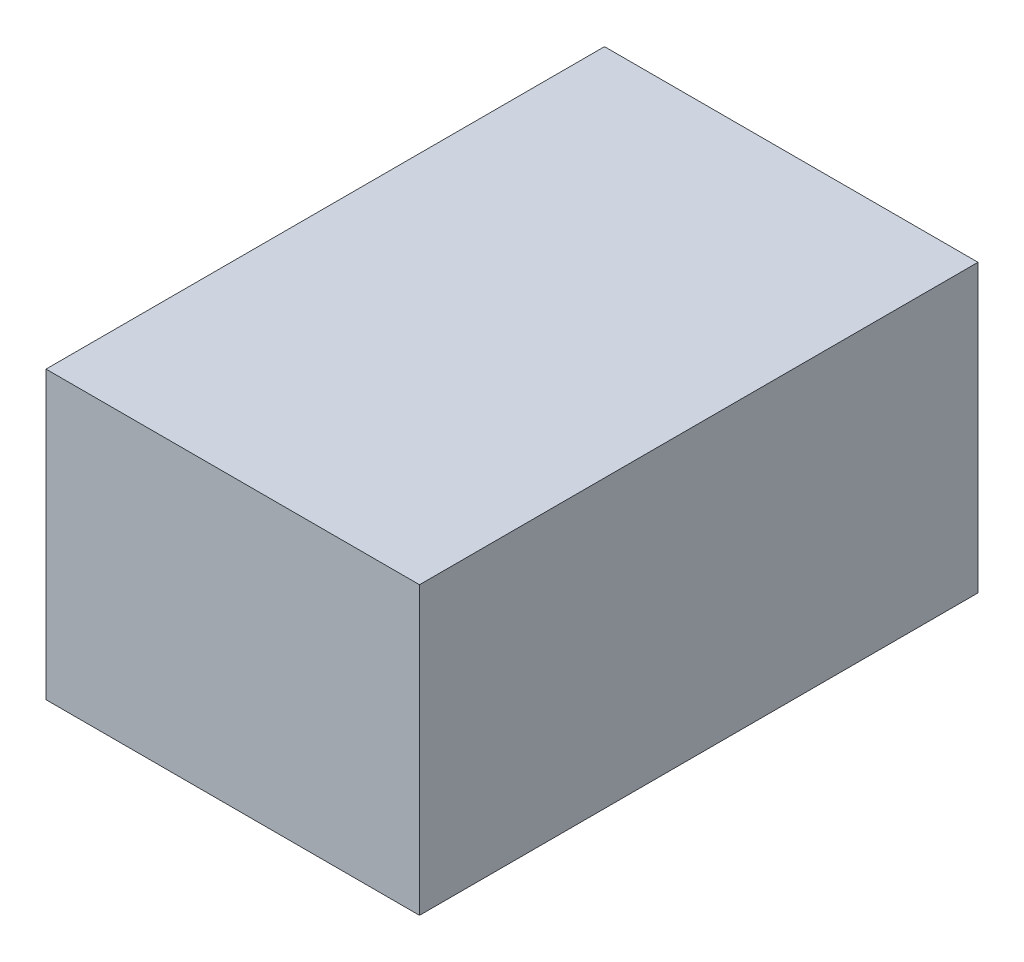
ISO-10303-21;
HEADER;
FILE_DESCRIPTION(('STEP AP214'),'2;1');
FILE_NAME('part.step','',(''),(''),'','','');
FILE_SCHEMA(('AUTOMOTIVE_DESIGN { 1 0 10303 214 1 1 1 1 }'));
ENDSEC;
DATA;
#1=APPLICATION_CONTEXT('core data for automotive mechanical design processes');
#2=APPLICATION_PROTOCOL_DEFINITION('international standard','automotive_design',2000,#1);
#3=PRODUCT_CONTEXT('',#1,'mechanical');
#4=PRODUCT('Part','Part','',(#3));
#5=PRODUCT_RELATED_PRODUCT_CATEGORY('part','',(#4));
#6=PRODUCT_DEFINITION_FORMATION('','',#4);
#7=PRODUCT_DEFINITION_CONTEXT('part definition',#1,'design');
#8=PRODUCT_DEFINITION('design','',#6,#7);
#9=PRODUCT_DEFINITION_SHAPE('','',#8);
#10=(LENGTH_UNIT() NAMED_UNIT(*) SI_UNIT(.MILLI.,.METRE.));
#11=(NAMED_UNIT(*) PLANE_ANGLE_UNIT() SI_UNIT($,.RADIAN.));
#12=(NAMED_UNIT(*) SI_UNIT($,.STERADIAN.) SOLID_ANGLE_UNIT());
#13=UNCERTAINTY_MEASURE_WITH_UNIT(LENGTH_MEASURE(1.E-05),#10,'distance_accuracy_value','');
#14=(GEOMETRIC_REPRESENTATION_CONTEXT(3) GLOBAL_UNCERTAINTY_ASSIGNED_CONTEXT((#13)) GLOBAL_UNIT_ASSIGNED_CONTEXT((#10,
#11,#12)) REPRESENTATION_CONTEXT('',''));
#15=CARTESIAN_POINT('',(0.,0.,0.));
#16=DIRECTION('',(0.,0.,1.));
#17=DIRECTION('',(1.,0.,0.));
#18=AXIS2_PLACEMENT_3D('',#15,#16,#17);
#19=CARTESIAN_POINT('',(22.8,-17.6367258706203,44.86));
#20=DIRECTION('',(-1.,0.,0.));
#21=DIRECTION('',(0.,-1.,0.));
#22=AXIS2_PLACEMENT_3D('',#19,#20,#21);
#23=PLANE('',#22);
#24=DIRECTION('',(0.,1.,0.));
#25=VECTOR('',#24,1.);
#26=CARTESIAN_POINT('',(22.8,-17.6367258706203,0.));
#27=LINE('',#26,#25);
#28=CARTESIAN_POINT('',(22.8,-40.6367258706203,0.));
#29=VERTEX_POINT('',#28);
#30=CARTESIAN_POINT('',(22.8,-17.6367258706203,0.));
#31=VERTEX_POINT('',#30);
#32=EDGE_CURVE('E96',#29,#31,#27,.T.);
#33=ORIENTED_EDGE('',*,*,#32,.T.);
#34=DIRECTION('',(0.,0.,-1.));
#35=VECTOR('',#34,1.);
#36=CARTESIAN_POINT('',(22.8,-17.6367258706203,44.86));
#37=LINE('',#36,#35);
#38=CARTESIAN_POINT('',(22.8,-17.6367258706203,44.86));
#39=VERTEX_POINT('',#38);
#40=EDGE_CURVE('E11',#39,#31,#37,.T.);
#41=ORIENTED_EDGE('',*,*,#40,.F.);
#42=DIRECTION('',(0.,1.,0.));
#43=VECTOR('',#42,1.);
#44=CARTESIAN_POINT('',(22.8,-17.6367258706203,44.86));
#45=LINE('',#44,#43);
#46=CARTESIAN_POINT('',(22.8,-40.6367258706203,44.86));
#47=VERTEX_POINT('',#46);
#48=EDGE_CURVE('E84',#47,#39,#45,.T.);
#49=ORIENTED_EDGE('',*,*,#48,.F.);
#50=DIRECTION('',(0.,0.,-1.));
#51=VECTOR('',#50,1.);
#52=CARTESIAN_POINT('',(22.8,-40.6367258706203,44.86));
#53=LINE('',#52,#51);
#54=EDGE_CURVE('E92',#47,#29,#53,.T.);
#55=ORIENTED_EDGE('',*,*,#54,.T.);
#56=EDGE_LOOP('',(#33,#41,#49,#55));
#57=FACE_BOUND('',#56,.T.);
#58=ADVANCED_FACE('F33',(#57),#23,.F.);
#59=CARTESIAN_POINT('',(22.8,-17.6367258706203,44.86));
#60=DIRECTION('',(0.,-1.,0.));
#61=DIRECTION('',(1.,0.,0.));
#62=AXIS2_PLACEMENT_3D('',#59,#60,#61);
#63=PLANE('',#62);
#64=DIRECTION('',(-1.,0.,0.));
#65=VECTOR('',#64,1.);
#66=CARTESIAN_POINT('',(22.8,-17.6367258706203,0.));
#67=LINE('',#66,#65);
#68=CARTESIAN_POINT('',(-7.19999999999999,-17.6367258706203,0.));
#69=VERTEX_POINT('',#68);
#70=EDGE_CURVE('E88',#31,#69,#67,.T.);
#71=ORIENTED_EDGE('',*,*,#70,.T.);
#72=DIRECTION('',(0.,0.,-1.));
#73=VECTOR('',#72,1.);
#74=CARTESIAN_POINT('',(-7.19999999999999,-17.6367258706203,44.86));
#75=LINE('',#74,#73);
#76=CARTESIAN_POINT('',(-7.19999999999999,-17.6367258706203,44.86));
#77=VERTEX_POINT('',#76);
#78=EDGE_CURVE('E41',#77,#69,#75,.T.);
#79=ORIENTED_EDGE('',*,*,#78,.F.);
#80=DIRECTION('',(-1.,0.,0.));
#81=VECTOR('',#80,1.);
#82=CARTESIAN_POINT('',(22.8,-17.6367258706203,44.86));
#83=LINE('',#82,#81);
#84=EDGE_CURVE('E79',#39,#77,#83,.T.);
#85=ORIENTED_EDGE('',*,*,#84,.F.);
#86=ORIENTED_EDGE('',*,*,#40,.T.);
#87=EDGE_LOOP('',(#71,#79,#85,#86));
#88=FACE_BOUND('',#87,.T.);
#89=ADVANCED_FACE('F87',(#88),#63,.F.);
#90=CARTESIAN_POINT('',(-7.19999999999999,-17.6367258706203,44.86));
#91=DIRECTION('',(1.,0.,0.));
#92=DIRECTION('',(0.,1.,0.));
#93=AXIS2_PLACEMENT_3D('',#90,#91,#92);
#94=PLANE('',#93);
#95=DIRECTION('',(0.,-1.,0.));
#96=VECTOR('',#95,1.);
#97=CARTESIAN_POINT('',(-7.19999999999999,-17.6367258706203,0.));
#98=LINE('',#97,#96);
#99=CARTESIAN_POINT('',(-7.19999999999999,-40.6367258706203,0.));
#100=VERTEX_POINT('',#99);
#101=EDGE_CURVE('E66',#69,#100,#98,.T.);
#102=ORIENTED_EDGE('',*,*,#101,.T.);
#103=DIRECTION('',(0.,0.,-1.));
#104=VECTOR('',#103,1.);
#105=CARTESIAN_POINT('',(-7.19999999999999,-40.6367258706203,44.86));
#106=LINE('',#105,#104);
#107=CARTESIAN_POINT('',(-7.19999999999999,-40.6367258706203,44.86));
#108=VERTEX_POINT('',#107);
#109=EDGE_CURVE('E89',#108,#100,#106,.T.);
#110=ORIENTED_EDGE('',*,*,#109,.F.);
#111=DIRECTION('',(0.,-1.,0.));
#112=VECTOR('',#111,1.);
#113=CARTESIAN_POINT('',(-7.19999999999999,-17.6367258706203,44.86));
#114=LINE('',#113,#112);
#115=EDGE_CURVE('E82',#77,#108,#114,.T.);
#116=ORIENTED_EDGE('',*,*,#115,.F.);
#117=ORIENTED_EDGE('',*,*,#78,.T.);
#118=EDGE_LOOP('',(#102,#110,#116,#117));
#119=FACE_BOUND('',#118,.T.);
#120=ADVANCED_FACE('F90',(#119),#94,.F.);
#121=CARTESIAN_POINT('',(22.8,-40.6367258706203,44.86));
#122=DIRECTION('',(0.,1.,0.));
#123=DIRECTION('',(0.,0.,1.));
#124=AXIS2_PLACEMENT_3D('',#121,#122,#123);
#125=PLANE('',#124);
#126=DIRECTION('',(1.,0.,0.));
#127=VECTOR('',#126,1.);
#128=CARTESIAN_POINT('',(22.8,-40.6367258706203,0.));
#129=LINE('',#128,#127);
#130=EDGE_CURVE('E72',#100,#29,#129,.T.);
#131=ORIENTED_EDGE('',*,*,#130,.T.);
#132=ORIENTED_EDGE('',*,*,#54,.F.);
#133=DIRECTION('',(1.,0.,0.));
#134=VECTOR('',#133,1.);
#135=CARTESIAN_POINT('',(22.8,-40.6367258706203,44.86));
#136=LINE('',#135,#134);
#137=EDGE_CURVE('E49',#108,#47,#136,.T.);
#138=ORIENTED_EDGE('',*,*,#137,.F.);
#139=ORIENTED_EDGE('',*,*,#109,.T.);
#140=EDGE_LOOP('',(#131,#132,#138,#139));
#141=FACE_BOUND('',#140,.T.);
#142=ADVANCED_FACE('F103',(#141),#125,.F.);
#143=CARTESIAN_POINT('',(0.,0.,44.86));
#144=DIRECTION('',(0.,0.,-1.));
#145=DIRECTION('',(-1.,0.,0.));
#146=AXIS2_PLACEMENT_3D('',#143,#144,#145);
#147=PLANE('',#146);
#148=ORIENTED_EDGE('',*,*,#48,.T.);
#149=ORIENTED_EDGE('',*,*,#84,.T.);
#150=ORIENTED_EDGE('',*,*,#115,.T.);
#151=ORIENTED_EDGE('',*,*,#137,.T.);
#152=EDGE_LOOP('',(#148,#149,#150,#151));
#153=FACE_BOUND('',#152,.T.);
#154=ADVANCED_FACE('F80',(#153),#147,.F.);
#155=CARTESIAN_POINT('',(0.,0.,0.));
#156=DIRECTION('',(0.,0.,-1.));
#157=DIRECTION('',(-1.,0.,0.));
#158=AXIS2_PLACEMENT_3D('',#155,#156,#157);
#159=PLANE('',#158);
#160=ORIENTED_EDGE('',*,*,#32,.F.);
#161=ORIENTED_EDGE('',*,*,#130,.F.);
#162=ORIENTED_EDGE('',*,*,#101,.F.);
#163=ORIENTED_EDGE('',*,*,#70,.F.);
#164=EDGE_LOOP('',(#160,#161,#162,#163));
#165=FACE_BOUND('',#164,.T.);
#166=ADVANCED_FACE('F106',(#165),#159,.T.);
#167=CLOSED_SHELL('',(#58,#89,#120,#142,#154,#166));
#168=MANIFOLD_SOLID_BREP('B2',#167);
#169=ADVANCED_BREP_SHAPE_REPRESENTATION('',(#18,#168),#14);
#170=SHAPE_DEFINITION_REPRESENTATION(#9,#169);
ENDSEC;
END-ISO-10303-21;
